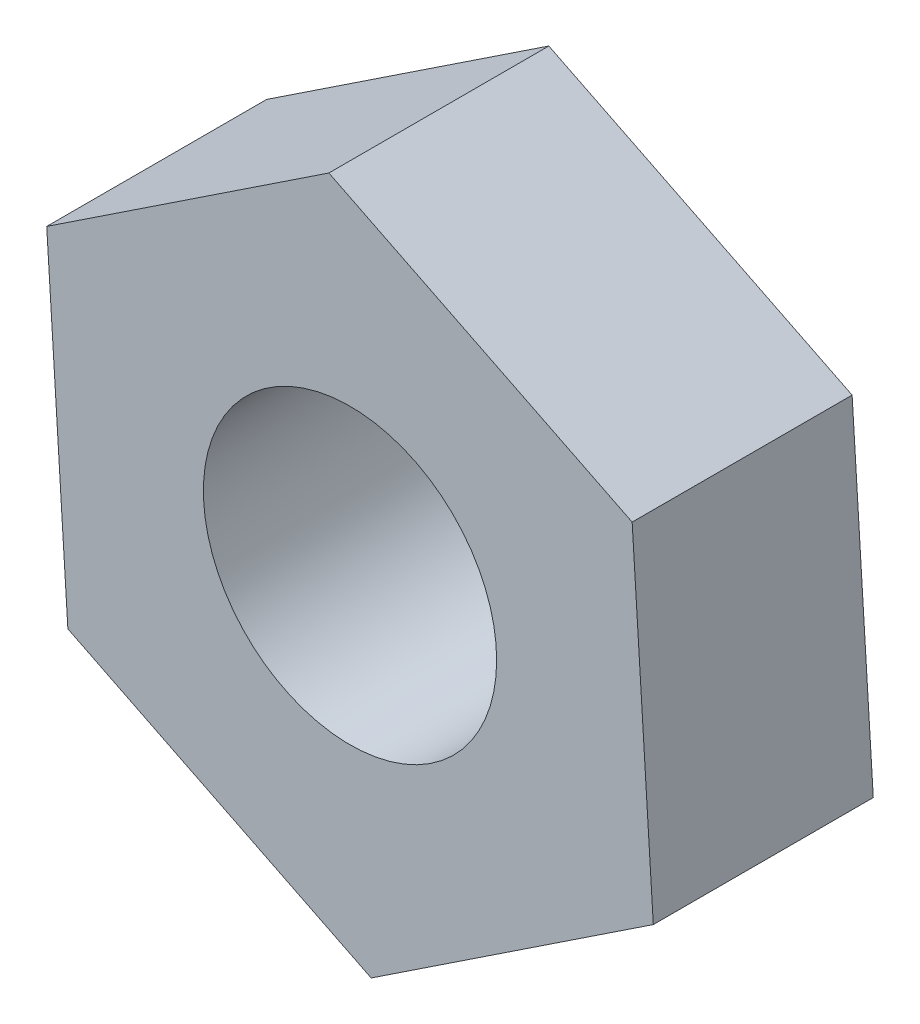
ISO-10303-21;
HEADER;
FILE_DESCRIPTION(('STEP AP214'),'2;1');
FILE_NAME('part.step','',(''),(''),'','','');
FILE_SCHEMA(('AUTOMOTIVE_DESIGN { 1 0 10303 214 1 1 1 1 }'));
ENDSEC;
DATA;
#1=APPLICATION_CONTEXT('core data for automotive mechanical design processes');
#2=APPLICATION_PROTOCOL_DEFINITION('international standard','automotive_design',2000,#1);
#3=PRODUCT_CONTEXT('',#1,'mechanical');
#4=PRODUCT('Part','Part','',(#3));
#5=PRODUCT_RELATED_PRODUCT_CATEGORY('part','',(#4));
#6=PRODUCT_DEFINITION_FORMATION('','',#4);
#7=PRODUCT_DEFINITION_CONTEXT('part definition',#1,'design');
#8=PRODUCT_DEFINITION('design','',#6,#7);
#9=PRODUCT_DEFINITION_SHAPE('','',#8);
#10=(LENGTH_UNIT() NAMED_UNIT(*) SI_UNIT(.MILLI.,.METRE.));
#11=(NAMED_UNIT(*) PLANE_ANGLE_UNIT() SI_UNIT($,.RADIAN.));
#12=(NAMED_UNIT(*) SI_UNIT($,.STERADIAN.) SOLID_ANGLE_UNIT());
#13=UNCERTAINTY_MEASURE_WITH_UNIT(LENGTH_MEASURE(1.E-05),#10,'distance_accuracy_value','');
#14=(GEOMETRIC_REPRESENTATION_CONTEXT(3) GLOBAL_UNCERTAINTY_ASSIGNED_CONTEXT((#13)) GLOBAL_UNIT_ASSIGNED_CONTEXT((#10,
#11,#12)) REPRESENTATION_CONTEXT('',''));
#15=CARTESIAN_POINT('',(0.,0.,0.));
#16=DIRECTION('',(0.,0.,1.));
#17=DIRECTION('',(1.,0.,0.));
#18=AXIS2_PLACEMENT_3D('',#15,#16,#17);
#19=CARTESIAN_POINT('',(-2.06822699232647,1.02750690583838,1.5));
#20=DIRECTION('',(0.998046892877419,0.0624691893474597,0.));
#21=DIRECTION('',(-0.0624691893474597,0.99804689287742,0.));
#22=AXIS2_PLACEMENT_3D('',#19,#20,#21);
#23=PLANE('',#22);
#24=DIRECTION('',(0.0624691893474597,-0.99804689287742,0.));
#25=VECTOR('',#24,1.);
#26=CARTESIAN_POINT('',(-2.06822699232647,1.02750690583838,0.));
#27=LINE('',#26,#25);
#28=CARTESIAN_POINT('',(-2.06822699232647,1.02750690583838,0.));
#29=VERTEX_POINT('',#28);
#30=CARTESIAN_POINT('',(-1.92396057918321,-1.27738366322821,0.));
#31=VERTEX_POINT('',#30);
#32=EDGE_CURVE('E125',#29,#31,#27,.T.);
#33=ORIENTED_EDGE('',*,*,#32,.T.);
#34=DIRECTION('',(0.,0.,-1.));
#35=VECTOR('',#34,1.);
#36=CARTESIAN_POINT('',(-1.92396057918321,-1.27738366322821,1.5));
#37=LINE('',#36,#35);
#38=CARTESIAN_POINT('',(-1.92396057918321,-1.27738366322821,1.5));
#39=VERTEX_POINT('',#38);
#40=EDGE_CURVE('E11',#39,#31,#37,.T.);
#41=ORIENTED_EDGE('',*,*,#40,.F.);
#42=DIRECTION('',(0.0624691893474597,-0.99804689287742,0.));
#43=VECTOR('',#42,1.);
#44=CARTESIAN_POINT('',(-2.06822699232647,1.02750690583838,1.5));
#45=LINE('',#44,#43);
#46=CARTESIAN_POINT('',(-2.06822699232647,1.02750690583838,1.5));
#47=VERTEX_POINT('',#46);
#48=EDGE_CURVE('E136',#47,#39,#45,.T.);
#49=ORIENTED_EDGE('',*,*,#48,.F.);
#50=DIRECTION('',(0.,0.,-1.));
#51=VECTOR('',#50,1.);
#52=CARTESIAN_POINT('',(-2.06822699232647,1.02750690583838,1.5));
#53=LINE('',#52,#51);
#54=EDGE_CURVE('E121',#47,#29,#53,.T.);
#55=ORIENTED_EDGE('',*,*,#54,.T.);
#56=EDGE_LOOP('',(#33,#41,#49,#55));
#57=FACE_BOUND('',#56,.T.);
#58=ADVANCED_FACE('F41',(#57),#23,.F.);
#59=CARTESIAN_POINT('',(-1.92396057918321,-1.27738366322821,1.5));
#60=DIRECTION('',(0.444923541509989,0.895568558073701,0.));
#61=DIRECTION('',(-0.895568558073702,0.444923541509989,0.));
#62=AXIS2_PLACEMENT_3D('',#59,#60,#61);
#63=PLANE('',#62);
#64=DIRECTION('',(0.895568558073702,-0.444923541509989,0.));
#65=VECTOR('',#64,1.);
#66=CARTESIAN_POINT('',(-1.92396057918321,-1.27738366322821,0.));
#67=LINE('',#66,#65);
#68=CARTESIAN_POINT('',(0.144266413143255,-2.30489056906659,0.));
#69=VERTEX_POINT('',#68);
#70=EDGE_CURVE('E128',#31,#69,#67,.T.);
#71=ORIENTED_EDGE('',*,*,#70,.T.);
#72=DIRECTION('',(0.,0.,-1.));
#73=VECTOR('',#72,1.);
#74=CARTESIAN_POINT('',(0.144266413143255,-2.30489056906659,1.5));
#75=LINE('',#74,#73);
#76=CARTESIAN_POINT('',(0.144266413143255,-2.30489056906659,1.5));
#77=VERTEX_POINT('',#76);
#78=EDGE_CURVE('E49',#77,#69,#75,.T.);
#79=ORIENTED_EDGE('',*,*,#78,.F.);
#80=DIRECTION('',(0.895568558073702,-0.444923541509989,0.));
#81=VECTOR('',#80,1.);
#82=CARTESIAN_POINT('',(-1.92396057918321,-1.27738366322821,1.5));
#83=LINE('',#82,#81);
#84=EDGE_CURVE('E94',#39,#77,#83,.T.);
#85=ORIENTED_EDGE('',*,*,#84,.F.);
#86=ORIENTED_EDGE('',*,*,#40,.T.);
#87=EDGE_LOOP('',(#71,#79,#85,#86));
#88=FACE_BOUND('',#87,.T.);
#89=ADVANCED_FACE('F161',(#88),#63,.F.);
#90=CARTESIAN_POINT('',(0.144266413143255,-2.30489056906659,1.5));
#91=DIRECTION('',(-0.55312335136743,0.833099368726242,0.));
#92=DIRECTION('',(-0.833099368726242,-0.55312335136743,0.));
#93=AXIS2_PLACEMENT_3D('',#90,#91,#92);
#94=PLANE('',#93);
#95=DIRECTION('',(0.833099368726241,0.55312335136743,0.));
#96=VECTOR('',#95,1.);
#97=CARTESIAN_POINT('',(0.144266413143255,-2.30489056906659,0.));
#98=LINE('',#97,#96);
#99=CARTESIAN_POINT('',(2.06822699232647,-1.02750690583837,0.));
#100=VERTEX_POINT('',#99);
#101=EDGE_CURVE('E131',#69,#100,#98,.T.);
#102=ORIENTED_EDGE('',*,*,#101,.T.);
#103=DIRECTION('',(0.,0.,-1.));
#104=VECTOR('',#103,1.);
#105=CARTESIAN_POINT('',(2.06822699232647,-1.02750690583837,1.5));
#106=LINE('',#105,#104);
#107=CARTESIAN_POINT('',(2.06822699232647,-1.02750690583837,1.5));
#108=VERTEX_POINT('',#107);
#109=EDGE_CURVE('E116',#108,#100,#106,.T.);
#110=ORIENTED_EDGE('',*,*,#109,.F.);
#111=DIRECTION('',(0.833099368726241,0.55312335136743,0.));
#112=VECTOR('',#111,1.);
#113=CARTESIAN_POINT('',(0.144266413143255,-2.30489056906659,1.5));
#114=LINE('',#113,#112);
#115=EDGE_CURVE('E107',#77,#108,#114,.T.);
#116=ORIENTED_EDGE('',*,*,#115,.F.);
#117=ORIENTED_EDGE('',*,*,#78,.T.);
#118=EDGE_LOOP('',(#102,#110,#116,#117));
#119=FACE_BOUND('',#118,.T.);
#120=ADVANCED_FACE('F142',(#119),#94,.F.);
#121=CARTESIAN_POINT('',(2.06822699232647,-1.02750690583837,1.5));
#122=DIRECTION('',(-0.998046892877419,-0.06246918934746,0.));
#123=DIRECTION('',(0.06246918934746,-0.99804689287742,0.));
#124=AXIS2_PLACEMENT_3D('',#121,#122,#123);
#125=PLANE('',#124);
#126=DIRECTION('',(-0.06246918934746,0.99804689287742,0.));
#127=VECTOR('',#126,1.);
#128=CARTESIAN_POINT('',(2.06822699232647,-1.02750690583837,0.));
#129=LINE('',#128,#127);
#130=CARTESIAN_POINT('',(1.92396057918321,1.27738366322822,0.));
#131=VERTEX_POINT('',#130);
#132=EDGE_CURVE('E115',#100,#131,#129,.T.);
#133=ORIENTED_EDGE('',*,*,#132,.T.);
#134=DIRECTION('',(0.,0.,-1.));
#135=VECTOR('',#134,1.);
#136=CARTESIAN_POINT('',(1.92396057918321,1.27738366322822,1.5));
#137=LINE('',#136,#135);
#138=CARTESIAN_POINT('',(1.92396057918321,1.27738366322822,1.5));
#139=VERTEX_POINT('',#138);
#140=EDGE_CURVE('E112',#139,#131,#137,.T.);
#141=ORIENTED_EDGE('',*,*,#140,.F.);
#142=DIRECTION('',(-0.06246918934746,0.99804689287742,0.));
#143=VECTOR('',#142,1.);
#144=CARTESIAN_POINT('',(2.06822699232647,-1.02750690583837,1.5));
#145=LINE('',#144,#143);
#146=EDGE_CURVE('E101',#108,#139,#145,.T.);
#147=ORIENTED_EDGE('',*,*,#146,.F.);
#148=ORIENTED_EDGE('',*,*,#109,.T.);
#149=EDGE_LOOP('',(#133,#141,#147,#148));
#150=FACE_BOUND('',#149,.T.);
#151=ADVANCED_FACE('F113',(#150),#125,.F.);
#152=CARTESIAN_POINT('',(1.92396057918321,1.27738366322822,1.5));
#153=DIRECTION('',(-0.444923541509989,-0.895568558073701,0.));
#154=DIRECTION('',(0.895568558073702,-0.444923541509989,0.));
#155=AXIS2_PLACEMENT_3D('',#152,#153,#154);
#156=PLANE('',#155);
#157=DIRECTION('',(-0.895568558073701,0.444923541509989,0.));
#158=VECTOR('',#157,1.);
#159=CARTESIAN_POINT('',(1.92396057918321,1.27738366322822,0.));
#160=LINE('',#159,#158);
#161=CARTESIAN_POINT('',(-0.144266413143254,2.30489056906659,0.));
#162=VERTEX_POINT('',#161);
#163=EDGE_CURVE('E80',#131,#162,#160,.T.);
#164=ORIENTED_EDGE('',*,*,#163,.T.);
#165=DIRECTION('',(0.,0.,-1.));
#166=VECTOR('',#165,1.);
#167=CARTESIAN_POINT('',(-0.144266413143254,2.30489056906659,1.5));
#168=LINE('',#167,#166);
#169=CARTESIAN_POINT('',(-0.144266413143254,2.30489056906659,1.5));
#170=VERTEX_POINT('',#169);
#171=EDGE_CURVE('E117',#170,#162,#168,.T.);
#172=ORIENTED_EDGE('',*,*,#171,.F.);
#173=DIRECTION('',(-0.895568558073701,0.444923541509989,0.));
#174=VECTOR('',#173,1.);
#175=CARTESIAN_POINT('',(1.92396057918321,1.27738366322822,1.5));
#176=LINE('',#175,#174);
#177=EDGE_CURVE('E105',#139,#170,#176,.T.);
#178=ORIENTED_EDGE('',*,*,#177,.F.);
#179=ORIENTED_EDGE('',*,*,#140,.T.);
#180=EDGE_LOOP('',(#164,#172,#178,#179));
#181=FACE_BOUND('',#180,.T.);
#182=ADVANCED_FACE('F119',(#181),#156,.F.);
#183=CARTESIAN_POINT('',(-0.144266413143254,2.30489056906659,1.5));
#184=DIRECTION('',(0.55312335136743,-0.833099368726242,0.));
#185=DIRECTION('',(0.833099368726242,0.55312335136743,0.));
#186=AXIS2_PLACEMENT_3D('',#183,#184,#185);
#187=PLANE('',#186);
#188=DIRECTION('',(-0.833099368726242,-0.55312335136743,0.));
#189=VECTOR('',#188,1.);
#190=CARTESIAN_POINT('',(-0.144266413143254,2.30489056906659,0.));
#191=LINE('',#190,#189);
#192=EDGE_CURVE('E86',#162,#29,#191,.T.);
#193=ORIENTED_EDGE('',*,*,#192,.T.);
#194=ORIENTED_EDGE('',*,*,#54,.F.);
#195=DIRECTION('',(-0.833099368726242,-0.55312335136743,0.));
#196=VECTOR('',#195,1.);
#197=CARTESIAN_POINT('',(-0.144266413143254,2.30489056906659,1.5));
#198=LINE('',#197,#196);
#199=EDGE_CURVE('E57',#170,#47,#198,.T.);
#200=ORIENTED_EDGE('',*,*,#199,.F.);
#201=ORIENTED_EDGE('',*,*,#171,.T.);
#202=EDGE_LOOP('',(#193,#194,#200,#201));
#203=FACE_BOUND('',#202,.T.);
#204=ADVANCED_FACE('F149',(#203),#187,.F.);
#205=CARTESIAN_POINT('',(0.,0.,1.5));
#206=DIRECTION('',(0.,0.,1.));
#207=DIRECTION('',(1.,0.,0.));
#208=AXIS2_PLACEMENT_3D('',#205,#206,#207);
#209=PLANE('',#208);
#210=CARTESIAN_POINT('',(0.,0.,1.5));
#211=DIRECTION('',(0.,0.,1.));
#212=DIRECTION('',(1.,0.,0.));
#213=AXIS2_PLACEMENT_3D('',#210,#211,#212);
#214=CIRCLE('',#213,1.);
#215=CARTESIAN_POINT('',(1.,0.,1.5));
#216=VERTEX_POINT('',#215);
#217=EDGE_CURVE('E206',#216,#216,#214,.T.);
#218=ORIENTED_EDGE('',*,*,#217,.F.);
#219=EDGE_LOOP('',(#218));
#220=FACE_BOUND('',#219,.T.);
#221=ORIENTED_EDGE('',*,*,#48,.T.);
#222=ORIENTED_EDGE('',*,*,#84,.T.);
#223=ORIENTED_EDGE('',*,*,#115,.T.);
#224=ORIENTED_EDGE('',*,*,#146,.T.);
#225=ORIENTED_EDGE('',*,*,#177,.T.);
#226=ORIENTED_EDGE('',*,*,#199,.T.);
#227=EDGE_LOOP('',(#221,#222,#223,#224,#225,#226));
#228=FACE_BOUND('',#227,.T.);
#229=ADVANCED_FACE('F103',(#220,#228),#209,.T.);
#230=CARTESIAN_POINT('',(0.,0.,0.));
#231=DIRECTION('',(0.,0.,1.));
#232=DIRECTION('',(1.,0.,0.));
#233=AXIS2_PLACEMENT_3D('',#230,#231,#232);
#234=PLANE('',#233);
#235=CARTESIAN_POINT('',(0.,0.,0.));
#236=DIRECTION('',(0.,0.,1.));
#237=DIRECTION('',(1.,0.,0.));
#238=AXIS2_PLACEMENT_3D('',#235,#236,#237);
#239=CIRCLE('',#238,1.);
#240=CARTESIAN_POINT('',(1.,0.,0.));
#241=VERTEX_POINT('',#240);
#242=EDGE_CURVE('E129',#241,#241,#239,.T.);
#243=ORIENTED_EDGE('',*,*,#242,.T.);
#244=EDGE_LOOP('',(#243));
#245=FACE_BOUND('',#244,.T.);
#246=ORIENTED_EDGE('',*,*,#32,.F.);
#247=ORIENTED_EDGE('',*,*,#192,.F.);
#248=ORIENTED_EDGE('',*,*,#163,.F.);
#249=ORIENTED_EDGE('',*,*,#132,.F.);
#250=ORIENTED_EDGE('',*,*,#101,.F.);
#251=ORIENTED_EDGE('',*,*,#70,.F.);
#252=EDGE_LOOP('',(#246,#247,#248,#249,#250,#251));
#253=FACE_BOUND('',#252,.T.);
#254=ADVANCED_FACE('F145',(#245,#253),#234,.F.);
#255=CARTESIAN_POINT('',(0.,0.,0.));
#256=DIRECTION('',(0.,0.,1.));
#257=DIRECTION('',(1.,0.,0.));
#258=AXIS2_PLACEMENT_3D('',#255,#256,#257);
#259=CYLINDRICAL_SURFACE('',#258,1.);
#260=ORIENTED_EDGE('',*,*,#242,.F.);
#261=EDGE_LOOP('',(#260));
#262=FACE_BOUND('',#261,.T.);
#263=ORIENTED_EDGE('',*,*,#217,.T.);
#264=EDGE_LOOP('',(#263));
#265=FACE_BOUND('',#264,.T.);
#266=ADVANCED_FACE('F192',(#262,#265),#259,.F.);
#267=CLOSED_SHELL('',(#58,#89,#120,#151,#182,#204,#229,#254,#266));
#268=MANIFOLD_SOLID_BREP('B2',#267);
#269=ADVANCED_BREP_SHAPE_REPRESENTATION('',(#18,#268),#14);
#270=SHAPE_DEFINITION_REPRESENTATION(#9,#269);
ENDSEC;
END-ISO-10303-21;
